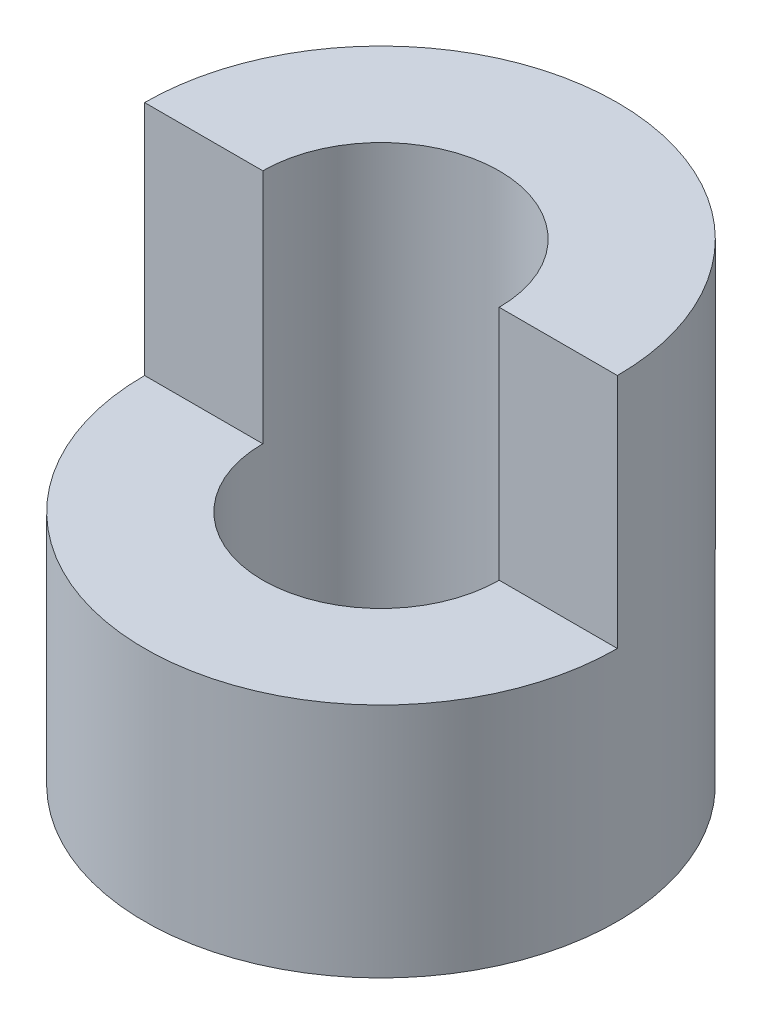
ISO-10303-21;
HEADER;
FILE_DESCRIPTION(('STEP AP214'),'2;1');
FILE_NAME('part.step','',(''),(''),'','','');
FILE_SCHEMA(('AUTOMOTIVE_DESIGN { 1 0 10303 214 1 1 1 1 }'));
ENDSEC;
DATA;
#1=APPLICATION_CONTEXT('core data for automotive mechanical design processes');
#2=APPLICATION_PROTOCOL_DEFINITION('international standard','automotive_design',2000,#1);
#3=PRODUCT_CONTEXT('',#1,'mechanical');
#4=PRODUCT('Part','Part','',(#3));
#5=PRODUCT_RELATED_PRODUCT_CATEGORY('part','',(#4));
#6=PRODUCT_DEFINITION_FORMATION('','',#4);
#7=PRODUCT_DEFINITION_CONTEXT('part definition',#1,'design');
#8=PRODUCT_DEFINITION('design','',#6,#7);
#9=PRODUCT_DEFINITION_SHAPE('','',#8);
#10=(LENGTH_UNIT() NAMED_UNIT(*) SI_UNIT(.MILLI.,.METRE.));
#11=(NAMED_UNIT(*) PLANE_ANGLE_UNIT() SI_UNIT($,.RADIAN.));
#12=(NAMED_UNIT(*) SI_UNIT($,.STERADIAN.) SOLID_ANGLE_UNIT());
#13=UNCERTAINTY_MEASURE_WITH_UNIT(LENGTH_MEASURE(1.E-05),#10,'distance_accuracy_value','');
#14=(GEOMETRIC_REPRESENTATION_CONTEXT(3) GLOBAL_UNCERTAINTY_ASSIGNED_CONTEXT((#13)) GLOBAL_UNIT_ASSIGNED_CONTEXT((#10,
#11,#12)) REPRESENTATION_CONTEXT('',''));
#15=CARTESIAN_POINT('',(0.,0.,0.));
#16=DIRECTION('',(0.,0.,1.));
#17=DIRECTION('',(1.,0.,0.));
#18=AXIS2_PLACEMENT_3D('',#15,#16,#17);
#19=CARTESIAN_POINT('',(0.,20.,0.));
#20=DIRECTION('',(0.,1.,0.));
#21=DIRECTION('',(0.,0.,1.));
#22=AXIS2_PLACEMENT_3D('',#19,#20,#21);
#23=PLANE('',#22);
#24=DIRECTION('',(-1.,0.,0.));
#25=VECTOR('',#24,1.);
#26=CARTESIAN_POINT('',(-10.,20.,0.));
#27=LINE('',#26,#25);
#28=CARTESIAN_POINT('',(-5.,20.,0.));
#29=VERTEX_POINT('',#28);
#30=CARTESIAN_POINT('',(-10.,20.,0.));
#31=VERTEX_POINT('',#30);
#32=EDGE_CURVE('E72',#29,#31,#27,.T.);
#33=ORIENTED_EDGE('',*,*,#32,.F.);
#34=CARTESIAN_POINT('',(0.,20.,0.));
#35=DIRECTION('',(0.,1.,0.));
#36=DIRECTION('',(0.,0.,1.));
#37=AXIS2_PLACEMENT_3D('',#34,#35,#36);
#38=CIRCLE('',#37,5.);
#39=CARTESIAN_POINT('',(5.,20.,0.));
#40=VERTEX_POINT('',#39);
#41=EDGE_CURVE('E101',#40,#29,#38,.T.);
#42=ORIENTED_EDGE('',*,*,#41,.F.);
#43=DIRECTION('',(-1.,0.,0.));
#44=VECTOR('',#43,1.);
#45=CARTESIAN_POINT('',(5.,20.,0.));
#46=LINE('',#45,#44);
#47=CARTESIAN_POINT('',(10.,20.,0.));
#48=VERTEX_POINT('',#47);
#49=EDGE_CURVE('E170',#48,#40,#46,.T.);
#50=ORIENTED_EDGE('',*,*,#49,.F.);
#51=CARTESIAN_POINT('',(0.,20.,0.));
#52=DIRECTION('',(0.,-1.,0.));
#53=DIRECTION('',(0.,0.,-1.));
#54=AXIS2_PLACEMENT_3D('',#51,#52,#53);
#55=CIRCLE('',#54,10.);
#56=EDGE_CURVE('E11',#31,#48,#55,.T.);
#57=ORIENTED_EDGE('',*,*,#56,.F.);
#58=EDGE_LOOP('',(#33,#42,#50,#57));
#59=FACE_BOUND('',#58,.T.);
#60=ADVANCED_FACE('F33',(#59),#23,.T.);
#61=CARTESIAN_POINT('',(0.,0.,0.));
#62=DIRECTION('',(0.,-1.,0.));
#63=DIRECTION('',(0.,0.,-1.));
#64=AXIS2_PLACEMENT_3D('',#61,#62,#63);
#65=CYLINDRICAL_SURFACE('',#64,10.);
#66=DIRECTION('',(0.,1.,0.));
#67=VECTOR('',#66,1.);
#68=CARTESIAN_POINT('',(-10.,10.,0.));
#69=LINE('',#68,#67);
#70=CARTESIAN_POINT('',(-10.,10.,0.));
#71=VERTEX_POINT('',#70);
#72=EDGE_CURVE('E56',#71,#31,#69,.T.);
#73=ORIENTED_EDGE('',*,*,#72,.T.);
#74=ORIENTED_EDGE('',*,*,#56,.T.);
#75=DIRECTION('',(0.,1.,0.));
#76=VECTOR('',#75,1.);
#77=CARTESIAN_POINT('',(10.,10.,0.));
#78=LINE('',#77,#76);
#79=CARTESIAN_POINT('',(10.,10.,0.));
#80=VERTEX_POINT('',#79);
#81=EDGE_CURVE('E76',#80,#48,#78,.T.);
#82=ORIENTED_EDGE('',*,*,#81,.F.);
#83=CARTESIAN_POINT('',(0.,10.,0.));
#84=DIRECTION('',(0.,1.,0.));
#85=DIRECTION('',(0.,0.,1.));
#86=AXIS2_PLACEMENT_3D('',#83,#84,#85);
#87=CIRCLE('',#86,10.);
#88=EDGE_CURVE('E82',#71,#80,#87,.T.);
#89=ORIENTED_EDGE('',*,*,#88,.F.);
#90=EDGE_LOOP('',(#73,#74,#82,#89));
#91=FACE_BOUND('',#90,.T.);
#92=CARTESIAN_POINT('',(0.,0.,0.));
#93=DIRECTION('',(0.,-1.,0.));
#94=DIRECTION('',(0.,0.,-1.));
#95=AXIS2_PLACEMENT_3D('',#92,#93,#94);
#96=CIRCLE('',#95,10.);
#97=CARTESIAN_POINT('',(0.,0.,-10.));
#98=VERTEX_POINT('',#97);
#99=EDGE_CURVE('E40',#98,#98,#96,.T.);
#100=ORIENTED_EDGE('',*,*,#99,.F.);
#101=EDGE_LOOP('',(#100));
#102=FACE_BOUND('',#101,.T.);
#103=ADVANCED_FACE('F89',(#91,#102),#65,.T.);
#104=CARTESIAN_POINT('',(0.,0.,0.));
#105=DIRECTION('',(0.,-1.,0.));
#106=DIRECTION('',(0.,0.,-1.));
#107=AXIS2_PLACEMENT_3D('',#104,#105,#106);
#108=PLANE('',#107);
#109=CARTESIAN_POINT('',(0.,0.,0.));
#110=DIRECTION('',(0.,1.,0.));
#111=DIRECTION('',(0.,0.,1.));
#112=AXIS2_PLACEMENT_3D('',#109,#110,#111);
#113=CIRCLE('',#112,5.);
#114=CARTESIAN_POINT('',(0.,0.,5.));
#115=VERTEX_POINT('',#114);
#116=EDGE_CURVE('E98',#115,#115,#113,.T.);
#117=ORIENTED_EDGE('',*,*,#116,.T.);
#118=EDGE_LOOP('',(#117));
#119=FACE_BOUND('',#118,.T.);
#120=ORIENTED_EDGE('',*,*,#99,.T.);
#121=EDGE_LOOP('',(#120));
#122=FACE_BOUND('',#121,.T.);
#123=ADVANCED_FACE('F106',(#119,#122),#108,.T.);
#124=CARTESIAN_POINT('',(0.,0.,0.));
#125=DIRECTION('',(0.,1.,0.));
#126=DIRECTION('',(0.,0.,1.));
#127=AXIS2_PLACEMENT_3D('',#124,#125,#126);
#128=CYLINDRICAL_SURFACE('',#127,5.);
#129=ORIENTED_EDGE('',*,*,#41,.T.);
#130=DIRECTION('',(0.,1.,0.));
#131=VECTOR('',#130,1.);
#132=CARTESIAN_POINT('',(-5.,10.,0.));
#133=LINE('',#132,#131);
#134=CARTESIAN_POINT('',(-5.,10.,0.));
#135=VERTEX_POINT('',#134);
#136=EDGE_CURVE('E93',#135,#29,#133,.T.);
#137=ORIENTED_EDGE('',*,*,#136,.F.);
#138=CARTESIAN_POINT('',(0.,10.,0.));
#139=DIRECTION('',(0.,-1.,0.));
#140=DIRECTION('',(0.,0.,1.));
#141=AXIS2_PLACEMENT_3D('',#138,#139,#140);
#142=CIRCLE('',#141,5.);
#143=CARTESIAN_POINT('',(5.,10.,0.));
#144=VERTEX_POINT('',#143);
#145=EDGE_CURVE('E81',#144,#135,#142,.T.);
#146=ORIENTED_EDGE('',*,*,#145,.F.);
#147=DIRECTION('',(0.,1.,0.));
#148=VECTOR('',#147,1.);
#149=CARTESIAN_POINT('',(5.,10.,0.));
#150=LINE('',#149,#148);
#151=EDGE_CURVE('E79',#144,#40,#150,.T.);
#152=ORIENTED_EDGE('',*,*,#151,.T.);
#153=EDGE_LOOP('',(#129,#137,#146,#152));
#154=FACE_BOUND('',#153,.T.);
#155=ORIENTED_EDGE('',*,*,#116,.F.);
#156=EDGE_LOOP('',(#155));
#157=FACE_BOUND('',#156,.T.);
#158=ADVANCED_FACE('F112',(#154,#157),#128,.F.);
#159=CARTESIAN_POINT('',(-10.,10.,0.));
#160=DIRECTION('',(0.,0.,-1.));
#161=DIRECTION('',(-1.,0.,0.));
#162=AXIS2_PLACEMENT_3D('',#159,#160,#161);
#163=PLANE('',#162);
#164=ORIENTED_EDGE('',*,*,#32,.T.);
#165=ORIENTED_EDGE('',*,*,#72,.F.);
#166=DIRECTION('',(-1.,0.,0.));
#167=VECTOR('',#166,1.);
#168=CARTESIAN_POINT('',(-10.,10.,0.));
#169=LINE('',#168,#167);
#170=EDGE_CURVE('E86',#135,#71,#169,.T.);
#171=ORIENTED_EDGE('',*,*,#170,.F.);
#172=ORIENTED_EDGE('',*,*,#136,.T.);
#173=EDGE_LOOP('',(#164,#165,#171,#172));
#174=FACE_BOUND('',#173,.T.);
#175=ADVANCED_FACE('F119',(#174),#163,.F.);
#176=CARTESIAN_POINT('',(5.,10.,0.));
#177=DIRECTION('',(0.,0.,-1.));
#178=DIRECTION('',(-1.,0.,0.));
#179=AXIS2_PLACEMENT_3D('',#176,#177,#178);
#180=PLANE('',#179);
#181=ORIENTED_EDGE('',*,*,#49,.T.);
#182=ORIENTED_EDGE('',*,*,#151,.F.);
#183=DIRECTION('',(-1.,0.,0.));
#184=VECTOR('',#183,1.);
#185=CARTESIAN_POINT('',(5.,10.,0.));
#186=LINE('',#185,#184);
#187=EDGE_CURVE('E47',#80,#144,#186,.T.);
#188=ORIENTED_EDGE('',*,*,#187,.F.);
#189=ORIENTED_EDGE('',*,*,#81,.T.);
#190=EDGE_LOOP('',(#181,#182,#188,#189));
#191=FACE_BOUND('',#190,.T.);
#192=ADVANCED_FACE('F74',(#191),#180,.F.);
#193=CARTESIAN_POINT('',(0.,10.,0.));
#194=DIRECTION('',(0.,1.,0.));
#195=DIRECTION('',(0.,0.,1.));
#196=AXIS2_PLACEMENT_3D('',#193,#194,#195);
#197=PLANE('',#196);
#198=ORIENTED_EDGE('',*,*,#88,.T.);
#199=ORIENTED_EDGE('',*,*,#187,.T.);
#200=ORIENTED_EDGE('',*,*,#145,.T.);
#201=ORIENTED_EDGE('',*,*,#170,.T.);
#202=EDGE_LOOP('',(#198,#199,#200,#201));
#203=FACE_BOUND('',#202,.T.);
#204=ADVANCED_FACE('F85',(#203),#197,.T.);
#205=CLOSED_SHELL('',(#60,#103,#123,#158,#175,#192,#204));
#206=MANIFOLD_SOLID_BREP('B2',#205);
#207=ADVANCED_BREP_SHAPE_REPRESENTATION('',(#18,#206),#14);
#208=SHAPE_DEFINITION_REPRESENTATION(#9,#207);
ENDSEC;
END-ISO-10303-21;
